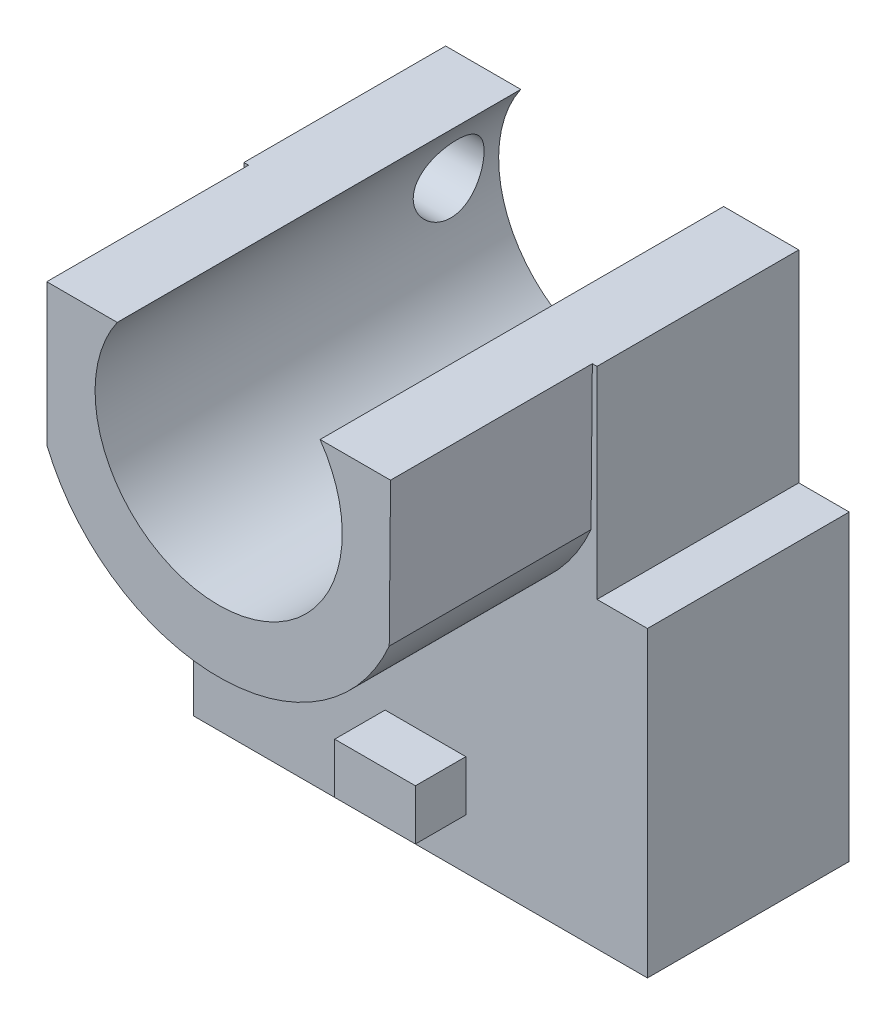
ISO-10303-21;
HEADER;
FILE_DESCRIPTION(('STEP AP214'),'2;1');
FILE_NAME('part.step','',(''),(''),'','','');
FILE_SCHEMA(('AUTOMOTIVE_DESIGN { 1 0 10303 214 1 1 1 1 }'));
ENDSEC;
DATA;
#1=APPLICATION_CONTEXT('core data for automotive mechanical design processes');
#2=APPLICATION_PROTOCOL_DEFINITION('international standard','automotive_design',2000,#1);
#3=PRODUCT_CONTEXT('',#1,'mechanical');
#4=PRODUCT('Part','Part','',(#3));
#5=PRODUCT_RELATED_PRODUCT_CATEGORY('part','',(#4));
#6=PRODUCT_DEFINITION_FORMATION('','',#4);
#7=PRODUCT_DEFINITION_CONTEXT('part definition',#1,'design');
#8=PRODUCT_DEFINITION('design','',#6,#7);
#9=PRODUCT_DEFINITION_SHAPE('','',#8);
#10=(LENGTH_UNIT() NAMED_UNIT(*) SI_UNIT(.MILLI.,.METRE.));
#11=(NAMED_UNIT(*) PLANE_ANGLE_UNIT() SI_UNIT($,.RADIAN.));
#12=(NAMED_UNIT(*) SI_UNIT($,.STERADIAN.) SOLID_ANGLE_UNIT());
#13=UNCERTAINTY_MEASURE_WITH_UNIT(LENGTH_MEASURE(1.E-05),#10,'distance_accuracy_value','');
#14=(GEOMETRIC_REPRESENTATION_CONTEXT(3) GLOBAL_UNCERTAINTY_ASSIGNED_CONTEXT((#13)) GLOBAL_UNIT_ASSIGNED_CONTEXT((#10,
#11,#12)) REPRESENTATION_CONTEXT('',''));
#15=CARTESIAN_POINT('',(0.,0.,0.));
#16=DIRECTION('',(0.,0.,1.));
#17=DIRECTION('',(1.,0.,0.));
#18=AXIS2_PLACEMENT_3D('',#15,#16,#17);
#19=CARTESIAN_POINT('',(0.,28.,0.));
#20=DIRECTION('',(0.,0.,1.));
#21=DIRECTION('',(1.,0.,0.));
#22=AXIS2_PLACEMENT_3D('',#19,#20,#21);
#23=CYLINDRICAL_SURFACE('',#22,12.25);
#24=CARTESIAN_POINT('',(0.,28.,0.));
#25=DIRECTION('',(0.,0.,-1.));
#26=DIRECTION('',(-1.,0.,0.));
#27=AXIS2_PLACEMENT_3D('',#24,#25,#26);
#28=CIRCLE('',#27,12.25);
#29=CARTESIAN_POINT('',(10.0529846314416,35.,0.));
#30=VERTEX_POINT('',#29);
#31=CARTESIAN_POINT('',(-10.0529846314416,35.,0.));
#32=VERTEX_POINT('',#31);
#33=EDGE_CURVE('E11',#30,#32,#28,.T.);
#34=ORIENTED_EDGE('',*,*,#33,.T.);
#35=DIRECTION('',(0.,0.,1.));
#36=VECTOR('',#35,1.);
#37=CARTESIAN_POINT('',(-10.0529846314416,35.,0.));
#38=LINE('',#37,#36);
#39=CARTESIAN_POINT('',(-10.0529846314416,35.,40.));
#40=VERTEX_POINT('',#39);
#41=EDGE_CURVE('E161',#40,#32,#38,.F.);
#42=ORIENTED_EDGE('',*,*,#41,.F.);
#43=CARTESIAN_POINT('',(0.,28.,40.));
#44=DIRECTION('',(0.,0.,-1.));
#45=DIRECTION('',(1.,0.,0.));
#46=AXIS2_PLACEMENT_3D('',#43,#44,#45);
#47=CIRCLE('',#46,12.25);
#48=CARTESIAN_POINT('',(10.0529846314416,35.,40.));
#49=VERTEX_POINT('',#48);
#50=EDGE_CURVE('E165',#49,#40,#47,.T.);
#51=ORIENTED_EDGE('',*,*,#50,.F.);
#52=DIRECTION('',(0.,0.,1.));
#53=VECTOR('',#52,1.);
#54=CARTESIAN_POINT('',(10.0529846314416,35.,0.));
#55=LINE('',#54,#53);
#56=EDGE_CURVE('E51',#30,#49,#55,.T.);
#57=ORIENTED_EDGE('',*,*,#56,.F.);
#58=EDGE_LOOP('',(#34,#42,#51,#57));
#59=FACE_BOUND('',#58,.T.);
#60=CARTESIAN_POINT('',(-12.2091154470748,29.,1.5));
#61=CARTESIAN_POINT('',(-12.1930980872203,29.1955129713642,1.50000503081726));
#62=CARTESIAN_POINT('',(-12.1723402241469,29.3906897416783,1.51643888098676));
#63=CARTESIAN_POINT('',(-12.1223292361413,29.7745963300911,1.58123481318833));
#64=CARTESIAN_POINT('',(-12.0930708422527,29.9633220682555,1.62961672160335));
#65=CARTESIAN_POINT('',(-12.0280366133363,30.328784077885,1.75628851431677));
#66=CARTESIAN_POINT('',(-11.9922739434438,30.5055435957649,1.83451832915782));
#67=CARTESIAN_POINT('',(-11.9167451029964,30.8431766478502,2.01844395063209));
#68=CARTESIAN_POINT('',(-11.8769785649761,31.0040487212554,2.1241422796698));
#69=CARTESIAN_POINT('',(-11.7951225617655,31.3111437164343,2.36412902893623));
#70=CARTESIAN_POINT('',(-11.7529996419516,31.4567171331488,2.49923799481785));
#71=CARTESIAN_POINT('',(-11.6712863629721,31.7233124749416,2.79254649816766));
#72=CARTESIAN_POINT('',(-11.6316964108957,31.8443304603142,2.9507497339208));
#73=CARTESIAN_POINT('',(-11.5583943347316,32.0594467023576,3.28821062937837));
#74=CARTESIAN_POINT('',(-11.5247474977448,32.1532524508381,3.46766981408768));
#75=CARTESIAN_POINT('',(-11.4674764272978,32.3088772408366,3.8414418769287));
#76=CARTESIAN_POINT('',(-11.4438474654366,32.3707113758738,4.03574769627506));
#77=CARTESIAN_POINT('',(-11.410334787606,32.4574457387886,4.42269906832443));
#78=CARTESIAN_POINT('',(-11.3997890108364,32.4841296001002,4.61488691704246));
#79=CARTESIAN_POINT('',(-11.391425416682,32.5053389550787,5.00127804766968));
#80=CARTESIAN_POINT('',(-11.3936034946627,32.4998748194802,5.19548065945074));
#81=CARTESIAN_POINT('',(-11.4099933260017,32.4581371180812,5.57013009655322));
#82=CARTESIAN_POINT('',(-11.4235993188343,32.4234141818151,5.75077983495531));
#83=CARTESIAN_POINT('',(-11.4606429896083,32.3265260485981,6.10348737581292));
#84=CARTESIAN_POINT('',(-11.484081919433,32.2643573573299,6.27554408112145));
#85=CARTESIAN_POINT('',(-11.5391818037293,32.1129530209087,6.6106176462821));
#86=CARTESIAN_POINT('',(-11.5710157952008,32.0231401557345,6.77334422268393));
#87=CARTESIAN_POINT('',(-11.6397955892846,31.8195784330688,7.08186517593523));
#88=CARTESIAN_POINT('',(-11.6767429879684,31.7058220961938,7.22765423976271));
#89=CARTESIAN_POINT('',(-11.7551752643657,31.449264901699,7.50787239670797));
#90=CARTESIAN_POINT('',(-11.79679932443,31.3050817661271,7.64099912040585));
#91=CARTESIAN_POINT('',(-11.8789752459643,30.9963227188584,7.88149302181361));
#92=CARTESIAN_POINT('',(-11.9195268882723,30.8317426772851,7.98885496982024));
#93=CARTESIAN_POINT('',(-11.9973655535853,30.4816624752081,8.17729220176969));
#94=CARTESIAN_POINT('',(-12.0345412817848,30.2957319531434,8.2576173808186));
#95=CARTESIAN_POINT('',(-12.1014967584556,29.9116030411019,8.38524888593171));
#96=CARTESIAN_POINT('',(-12.1312783687501,29.7134077551007,8.43256352942142));
#97=CARTESIAN_POINT('',(-12.1805300119735,29.3174370190392,8.49112091624577));
#98=CARTESIAN_POINT('',(-12.2003141702326,29.1198732073973,8.50352732142497));
#99=CARTESIAN_POINT('',(-12.2301441399152,28.7247695140081,8.49474847533401));
#100=CARTESIAN_POINT('',(-12.2401922876535,28.5272296378992,8.47357128621339));
#101=CARTESIAN_POINT('',(-12.2505626846218,28.145802420457,8.39950749657504));
#102=CARTESIAN_POINT('',(-12.2512419566699,27.9616818355372,8.347863679134));
#103=CARTESIAN_POINT('',(-12.2449154925053,27.6044169835455,8.21537675845554));
#104=CARTESIAN_POINT('',(-12.2379095699848,27.4312729826802,8.13453294737115));
#105=CARTESIAN_POINT('',(-12.2180335411638,27.1001061823282,7.94565372796331));
#106=CARTESIAN_POINT('',(-12.2051429774458,26.9421384802955,7.83752405423797));
#107=CARTESIAN_POINT('',(-12.1758601036594,26.6460802733183,7.59719638365613));
#108=CARTESIAN_POINT('',(-12.1594672178233,26.5079930428981,7.46499442994271));
#109=CARTESIAN_POINT('',(-12.1253090920398,26.2516900148154,7.1760297690231));
#110=CARTESIAN_POINT('',(-12.1075184723445,26.1341272832537,7.01869025217192));
#111=CARTESIAN_POINT('',(-12.0737570567436,25.9268482424985,6.68643974479423));
#112=CARTESIAN_POINT('',(-12.0577863286669,25.8371329709882,6.51152809979674));
#113=CARTESIAN_POINT('',(-12.0300077321576,25.6875817725306,6.14754743318605));
#114=CARTESIAN_POINT('',(-12.0182306309649,25.6279653916063,5.95838563404637));
#115=CARTESIAN_POINT('',(-12.0008389439693,25.5414759713944,5.5724535834886));
#116=CARTESIAN_POINT('',(-11.9952234412438,25.5145980601491,5.37568446864674));
#117=CARTESIAN_POINT('',(-11.9910725888643,25.4946502044732,4.98404256632654));
#118=CARTESIAN_POINT('',(-11.9924076011708,25.5009612560835,4.78920249457696));
#119=CARTESIAN_POINT('',(-12.0016538382016,25.5457554243497,4.40342455701075));
#120=CARTESIAN_POINT('',(-12.0095649863922,25.5842381665884,4.2124866458069));
#121=CARTESIAN_POINT('',(-12.0307081561294,25.6918579725359,3.84094767635159));
#122=CARTESIAN_POINT('',(-12.0439102905753,25.7608230725031,3.66029495899033));
#123=CARTESIAN_POINT('',(-12.0736817879557,25.927361490742,3.31299298091541));
#124=CARTESIAN_POINT('',(-12.090251561829,26.0249383010222,3.14634543270392));
#125=CARTESIAN_POINT('',(-12.1246172861235,26.248115281782,2.82847167564143));
#126=CARTESIAN_POINT('',(-12.1424302323431,26.3741997938702,2.67758718243637));
#127=CARTESIAN_POINT('',(-12.176172019913,26.6499667955782,2.39888949881288));
#128=CARTESIAN_POINT('',(-12.1921006113035,26.799652409756,2.27107936802976));
#129=CARTESIAN_POINT('',(-12.2193801145035,27.119576264496,2.04145135396492));
#130=CARTESIAN_POINT('',(-12.2307026293489,27.2899338368683,1.93979608880252));
#131=CARTESIAN_POINT('',(-12.2461609850595,27.6455720238479,1.7666456384792));
#132=CARTESIAN_POINT('',(-12.2503016024115,27.8308426343193,1.69513043195674));
#133=CARTESIAN_POINT('',(-12.2497151602724,28.1797708498133,1.59343422092879));
#134=CARTESIAN_POINT('',(-12.2463212592972,28.3420405645986,1.55842125359269));
#135=CARTESIAN_POINT('',(-12.2327829442078,28.6696201463996,1.5117024524221));
#136=CARTESIAN_POINT('',(-12.2226387809539,28.8349299002161,1.49999575251963));
#137=CARTESIAN_POINT('',(-12.2091154470748,29.,1.5));
#138=B_SPLINE_CURVE_WITH_KNOTS('',3,(#60,#61,#62,#63,#64,#65,#66,#67,#68,#69,#70,#71,#72,#73,
#74,#75,#76,#77,#78,#79,#80,#81,#82,#83,#84,#85,#86,#87,#88,#89,#90,#91,#92,#93,#94,#95,#96,#97,
#98,#99,#100,#101,#102,#103,#104,#105,#106,#107,#108,#109,#110,#111,#112,#113,#114,#115,#116,
#117,#118,#119,#120,#121,#122,#123,#124,#125,#126,#127,#128,#129,#130,#131,#132,#133,#134,#135,
#136,#137),.UNSPECIFIED.,.T.,.F.,(4,2,2,2,2,2,2,2,2,2,2,2,2,2,2,2,2,2,2,2,2,2,2,2,2,2,2,2,2,2,2,
2,2,2,2,2,2,2,4),(0.,0.587880441932936,1.17612605505794,1.76319400486733,2.35031588356388,
2.95660068582212,3.56298268442801,4.17565980165373,4.78804741467521,5.36798194246394,
5.94772939740565,6.49855423618946,7.0494492246962,7.61273223354822,8.17619146074328,
8.77530107282884,9.37453218880207,9.98923183724972,10.6037765482913,11.1975779538198,
11.7912368316894,12.3622075919216,12.9331921941791,13.5061770685553,14.0792562119081,
14.6681403578694,15.257046444859,15.8501881950818,16.4432416664485,17.0252738430372,
17.6072992459753,18.1860822946576,18.7649360122093,19.3544820489278,19.944106201484,
20.5373122844411,21.1301236904911,21.6264850767771,22.1228280177789),.UNSPECIFIED.);
#139=CARTESIAN_POINT('',(-12.2091154470748,29.,1.5));
#140=VERTEX_POINT('',#139);
#141=EDGE_CURVE('E36',#140,#140,#138,.T.);
#142=ORIENTED_EDGE('',*,*,#141,.F.);
#143=EDGE_LOOP('',(#142));
#144=FACE_BOUND('',#143,.T.);
#145=ADVANCED_FACE('F32',(#59,#144),#23,.F.);
#146=CARTESIAN_POINT('',(0.,0.,20.));
#147=DIRECTION('',(0.,0.,-1.));
#148=DIRECTION('',(-1.,0.,0.));
#149=AXIS2_PLACEMENT_3D('',#146,#147,#148);
#150=PLANE('',#149);
#151=DIRECTION('',(-1.,0.,0.));
#152=VECTOR('',#151,1.);
#153=CARTESIAN_POINT('',(4.5,-5.,20.));
#154=LINE('',#153,#152);
#155=CARTESIAN_POINT('',(4.5,-5.,20.));
#156=VERTEX_POINT('',#155);
#157=CARTESIAN_POINT('',(-3.5,-5.,20.));
#158=VERTEX_POINT('',#157);
#159=EDGE_CURVE('E214',#156,#158,#154,.T.);
#160=ORIENTED_EDGE('',*,*,#159,.F.);
#161=DIRECTION('',(0.,-1.,0.));
#162=VECTOR('',#161,1.);
#163=CARTESIAN_POINT('',(4.5,-5.,20.));
#164=LINE('',#163,#162);
#165=CARTESIAN_POINT('',(4.5,-10.,20.));
#166=VERTEX_POINT('',#165);
#167=EDGE_CURVE('E209',#156,#166,#164,.T.);
#168=ORIENTED_EDGE('',*,*,#167,.T.);
#169=DIRECTION('',(-1.,0.,0.));
#170=VECTOR('',#169,1.);
#171=CARTESIAN_POINT('',(4.5,-10.,20.));
#172=LINE('',#171,#170);
#173=CARTESIAN_POINT('',(-3.5,-10.,20.));
#174=VERTEX_POINT('',#173);
#175=EDGE_CURVE('E224',#166,#174,#172,.T.);
#176=ORIENTED_EDGE('',*,*,#175,.T.);
#177=DIRECTION('',(0.,-1.,0.));
#178=VECTOR('',#177,1.);
#179=CARTESIAN_POINT('',(-3.5,-5.,20.));
#180=LINE('',#179,#178);
#181=EDGE_CURVE('E59',#158,#174,#180,.T.);
#182=ORIENTED_EDGE('',*,*,#181,.F.);
#183=EDGE_LOOP('',(#160,#168,#176,#182));
#184=FACE_BOUND('',#183,.T.);
#185=DIRECTION('',(0.,-1.,0.));
#186=VECTOR('',#185,1.);
#187=CARTESIAN_POINT('',(-17.0367250374008,35.,20.));
#188=LINE('',#187,#186);
#189=CARTESIAN_POINT('',(-17.0367250374008,35.,20.));
#190=VERTEX_POINT('',#189);
#191=CARTESIAN_POINT('',(-17.0367250374008,21.,20.));
#192=VERTEX_POINT('',#191);
#193=EDGE_CURVE('E196',#190,#192,#188,.T.);
#194=ORIENTED_EDGE('',*,*,#193,.F.);
#195=DIRECTION('',(-1.,0.,0.));
#196=VECTOR('',#195,1.);
#197=CARTESIAN_POINT('',(-17.5,35.,20.));
#198=LINE('',#197,#196);
#199=CARTESIAN_POINT('',(-17.5,35.,20.));
#200=VERTEX_POINT('',#199);
#201=EDGE_CURVE('E245',#190,#200,#198,.T.);
#202=ORIENTED_EDGE('',*,*,#201,.T.);
#203=DIRECTION('',(0.,-1.,0.));
#204=VECTOR('',#203,1.);
#205=CARTESIAN_POINT('',(-17.5,15.,20.));
#206=LINE('',#205,#204);
#207=CARTESIAN_POINT('',(-17.5,15.,20.));
#208=VERTEX_POINT('',#207);
#209=EDGE_CURVE('E249',#200,#208,#206,.T.);
#210=ORIENTED_EDGE('',*,*,#209,.T.);
#211=DIRECTION('',(-1.,0.,0.));
#212=VECTOR('',#211,1.);
#213=CARTESIAN_POINT('',(-22.5,15.,20.));
#214=LINE('',#213,#212);
#215=CARTESIAN_POINT('',(-22.5,15.,20.));
#216=VERTEX_POINT('',#215);
#217=EDGE_CURVE('E251',#208,#216,#214,.T.);
#218=ORIENTED_EDGE('',*,*,#217,.T.);
#219=DIRECTION('',(0.,-1.,0.));
#220=VECTOR('',#219,1.);
#221=CARTESIAN_POINT('',(-22.5,-15.,20.));
#222=LINE('',#221,#220);
#223=CARTESIAN_POINT('',(-22.5,-15.,20.));
#224=VERTEX_POINT('',#223);
#225=EDGE_CURVE('E253',#216,#224,#222,.T.);
#226=ORIENTED_EDGE('',*,*,#225,.T.);
#227=DIRECTION('',(1.,0.,0.));
#228=VECTOR('',#227,1.);
#229=CARTESIAN_POINT('',(-22.5,-15.,20.));
#230=LINE('',#229,#228);
#231=CARTESIAN_POINT('',(22.5,-15.,20.));
#232=VERTEX_POINT('',#231);
#233=EDGE_CURVE('E255',#224,#232,#230,.T.);
#234=ORIENTED_EDGE('',*,*,#233,.T.);
#235=DIRECTION('',(0.,1.,0.));
#236=VECTOR('',#235,1.);
#237=CARTESIAN_POINT('',(22.5,-15.,20.));
#238=LINE('',#237,#236);
#239=CARTESIAN_POINT('',(22.5,15.,20.));
#240=VERTEX_POINT('',#239);
#241=EDGE_CURVE('E237',#232,#240,#238,.T.);
#242=ORIENTED_EDGE('',*,*,#241,.T.);
#243=DIRECTION('',(-1.,0.,0.));
#244=VECTOR('',#243,1.);
#245=CARTESIAN_POINT('',(17.5,15.,20.));
#246=LINE('',#245,#244);
#247=CARTESIAN_POINT('',(17.5,15.,20.));
#248=VERTEX_POINT('',#247);
#249=EDGE_CURVE('E240',#240,#248,#246,.T.);
#250=ORIENTED_EDGE('',*,*,#249,.T.);
#251=DIRECTION('',(0.,1.,0.));
#252=VECTOR('',#251,1.);
#253=CARTESIAN_POINT('',(17.5,15.,20.));
#254=LINE('',#253,#252);
#255=CARTESIAN_POINT('',(17.5,35.,20.));
#256=VERTEX_POINT('',#255);
#257=EDGE_CURVE('E243',#248,#256,#254,.T.);
#258=ORIENTED_EDGE('',*,*,#257,.T.);
#259=CARTESIAN_POINT('',(17.0367250374008,35.,20.));
#260=VERTEX_POINT('',#259);
#261=EDGE_CURVE('E246',#256,#260,#198,.T.);
#262=ORIENTED_EDGE('',*,*,#261,.T.);
#263=DIRECTION('',(0.0090933515019987,0.999958654624511,0.));
#264=VECTOR('',#263,1.);
#265=CARTESIAN_POINT('',(17.0367250374008,35.,20.));
#266=LINE('',#265,#264);
#267=CARTESIAN_POINT('',(16.9066058789967,20.6913285986936,20.));
#268=VERTEX_POINT('',#267);
#269=EDGE_CURVE('E182',#268,#260,#266,.T.);
#270=ORIENTED_EDGE('',*,*,#269,.F.);
#271=CARTESIAN_POINT('',(0.,28.,20.));
#272=DIRECTION('',(0.,0.,1.));
#273=DIRECTION('',(1.,0.,0.));
#274=AXIS2_PLACEMENT_3D('',#271,#272,#273);
#275=CIRCLE('',#274,18.4187404563939);
#276=EDGE_CURVE('E184',#192,#268,#275,.T.);
#277=ORIENTED_EDGE('',*,*,#276,.F.);
#278=EDGE_LOOP('',(#194,#202,#210,#218,#226,#234,#242,#250,#258,#262,#270,#277));
#279=FACE_BOUND('',#278,.T.);
#280=ADVANCED_FACE('F321',(#184,#279),#150,.F.);
#281=CARTESIAN_POINT('',(-17.5,35.,20.));
#282=DIRECTION('',(0.,-1.,0.));
#283=DIRECTION('',(0.,0.,-1.));
#284=AXIS2_PLACEMENT_3D('',#281,#282,#283);
#285=PLANE('',#284);
#286=DIRECTION('',(-1.,0.,0.));
#287=VECTOR('',#286,1.);
#288=CARTESIAN_POINT('',(-17.5,35.,0.));
#289=LINE('',#288,#287);
#290=CARTESIAN_POINT('',(17.5,35.,0.));
#291=VERTEX_POINT('',#290);
#292=EDGE_CURVE('E265',#291,#30,#289,.T.);
#293=ORIENTED_EDGE('',*,*,#292,.T.);
#294=ORIENTED_EDGE('',*,*,#56,.T.);
#295=DIRECTION('',(-1.,0.,0.));
#296=VECTOR('',#295,1.);
#297=CARTESIAN_POINT('',(10.0529846314416,35.,40.));
#298=LINE('',#297,#296);
#299=CARTESIAN_POINT('',(17.0367250374008,35.,40.));
#300=VERTEX_POINT('',#299);
#301=EDGE_CURVE('E181',#300,#49,#298,.T.);
#302=ORIENTED_EDGE('',*,*,#301,.F.);
#303=DIRECTION('',(0.,0.,-1.));
#304=VECTOR('',#303,1.);
#305=CARTESIAN_POINT('',(17.0367250374008,35.,40.));
#306=LINE('',#305,#304);
#307=EDGE_CURVE('E195',#300,#260,#306,.T.);
#308=ORIENTED_EDGE('',*,*,#307,.T.);
#309=ORIENTED_EDGE('',*,*,#261,.F.);
#310=DIRECTION('',(0.,0.,-1.));
#311=VECTOR('',#310,1.);
#312=CARTESIAN_POINT('',(17.5,35.,20.));
#313=LINE('',#312,#311);
#314=EDGE_CURVE('E289',#256,#291,#313,.T.);
#315=ORIENTED_EDGE('',*,*,#314,.T.);
#316=EDGE_LOOP('',(#293,#294,#302,#308,#309,#315));
#317=FACE_BOUND('',#316,.T.);
#318=ADVANCED_FACE('F316',(#317),#285,.F.);
#319=CARTESIAN_POINT('',(22.5,-15.,20.));
#320=DIRECTION('',(-1.,0.,0.));
#321=DIRECTION('',(0.,0.,1.));
#322=AXIS2_PLACEMENT_3D('',#319,#320,#321);
#323=PLANE('',#322);
#324=DIRECTION('',(0.,1.,0.));
#325=VECTOR('',#324,1.);
#326=CARTESIAN_POINT('',(22.5,-15.,0.));
#327=LINE('',#326,#325);
#328=CARTESIAN_POINT('',(22.5,-15.,0.));
#329=VERTEX_POINT('',#328);
#330=CARTESIAN_POINT('',(22.5,15.,0.));
#331=VERTEX_POINT('',#330);
#332=EDGE_CURVE('E231',#329,#331,#327,.T.);
#333=ORIENTED_EDGE('',*,*,#332,.T.);
#334=DIRECTION('',(0.,0.,-1.));
#335=VECTOR('',#334,1.);
#336=CARTESIAN_POINT('',(22.5,15.,20.));
#337=LINE('',#336,#335);
#338=EDGE_CURVE('E45',#240,#331,#337,.T.);
#339=ORIENTED_EDGE('',*,*,#338,.F.);
#340=ORIENTED_EDGE('',*,*,#241,.F.);
#341=DIRECTION('',(0.,0.,-1.));
#342=VECTOR('',#341,1.);
#343=CARTESIAN_POINT('',(22.5,-15.,20.));
#344=LINE('',#343,#342);
#345=EDGE_CURVE('E257',#232,#329,#344,.T.);
#346=ORIENTED_EDGE('',*,*,#345,.T.);
#347=EDGE_LOOP('',(#333,#339,#340,#346));
#348=FACE_BOUND('',#347,.T.);
#349=ADVANCED_FACE('F34',(#348),#323,.F.);
#350=CARTESIAN_POINT('',(17.5,15.,20.));
#351=DIRECTION('',(0.,-1.,0.));
#352=DIRECTION('',(0.,0.,-1.));
#353=AXIS2_PLACEMENT_3D('',#350,#351,#352);
#354=PLANE('',#353);
#355=DIRECTION('',(-1.,0.,0.));
#356=VECTOR('',#355,1.);
#357=CARTESIAN_POINT('',(17.5,15.,0.));
#358=LINE('',#357,#356);
#359=CARTESIAN_POINT('',(17.5,15.,0.));
#360=VERTEX_POINT('',#359);
#361=EDGE_CURVE('E260',#331,#360,#358,.T.);
#362=ORIENTED_EDGE('',*,*,#361,.T.);
#363=DIRECTION('',(0.,0.,-1.));
#364=VECTOR('',#363,1.);
#365=CARTESIAN_POINT('',(17.5,15.,20.));
#366=LINE('',#365,#364);
#367=EDGE_CURVE('E292',#248,#360,#366,.T.);
#368=ORIENTED_EDGE('',*,*,#367,.F.);
#369=ORIENTED_EDGE('',*,*,#249,.F.);
#370=ORIENTED_EDGE('',*,*,#338,.T.);
#371=EDGE_LOOP('',(#362,#368,#369,#370));
#372=FACE_BOUND('',#371,.T.);
#373=ADVANCED_FACE('F298',(#372),#354,.F.);
#374=CARTESIAN_POINT('',(17.5,15.,20.));
#375=DIRECTION('',(-1.,0.,0.));
#376=DIRECTION('',(0.,0.,1.));
#377=AXIS2_PLACEMENT_3D('',#374,#375,#376);
#378=PLANE('',#377);
#379=DIRECTION('',(0.,1.,0.));
#380=VECTOR('',#379,1.);
#381=CARTESIAN_POINT('',(17.5,15.,0.));
#382=LINE('',#381,#380);
#383=EDGE_CURVE('E262',#360,#291,#382,.T.);
#384=ORIENTED_EDGE('',*,*,#383,.T.);
#385=ORIENTED_EDGE('',*,*,#314,.F.);
#386=ORIENTED_EDGE('',*,*,#257,.F.);
#387=ORIENTED_EDGE('',*,*,#367,.T.);
#388=EDGE_LOOP('',(#384,#385,#386,#387));
#389=FACE_BOUND('',#388,.T.);
#390=ADVANCED_FACE('F312',(#389),#378,.F.);
#391=ORIENTED_EDGE('',*,*,#201,.F.);
#392=DIRECTION('',(0.,0.,-1.));
#393=VECTOR('',#392,1.);
#394=CARTESIAN_POINT('',(-17.0367250374008,35.,40.));
#395=LINE('',#394,#393);
#396=CARTESIAN_POINT('',(-17.0367250374008,35.,40.));
#397=VERTEX_POINT('',#396);
#398=EDGE_CURVE('E168',#397,#190,#395,.T.);
#399=ORIENTED_EDGE('',*,*,#398,.F.);
#400=DIRECTION('',(-1.,0.,0.));
#401=VECTOR('',#400,1.);
#402=CARTESIAN_POINT('',(-17.0367250374008,35.,40.));
#403=LINE('',#402,#401);
#404=EDGE_CURVE('E171',#40,#397,#403,.T.);
#405=ORIENTED_EDGE('',*,*,#404,.F.);
#406=ORIENTED_EDGE('',*,*,#41,.T.);
#407=CARTESIAN_POINT('',(-17.5,35.,0.));
#408=VERTEX_POINT('',#407);
#409=EDGE_CURVE('E264',#32,#408,#289,.T.);
#410=ORIENTED_EDGE('',*,*,#409,.T.);
#411=DIRECTION('',(0.,0.,-1.));
#412=VECTOR('',#411,1.);
#413=CARTESIAN_POINT('',(-17.5,35.,20.));
#414=LINE('',#413,#412);
#415=EDGE_CURVE('E286',#200,#408,#414,.T.);
#416=ORIENTED_EDGE('',*,*,#415,.F.);
#417=EDGE_LOOP('',(#391,#399,#405,#406,#410,#416));
#418=FACE_BOUND('',#417,.T.);
#419=ADVANCED_FACE('F173',(#418),#285,.F.);
#420=CARTESIAN_POINT('',(-17.5,15.,20.));
#421=DIRECTION('',(1.,0.,0.));
#422=DIRECTION('',(0.,0.,-1.));
#423=AXIS2_PLACEMENT_3D('',#420,#421,#422);
#424=PLANE('',#423);
#425=CARTESIAN_POINT('',(-17.5,29.,5.));
#426=DIRECTION('',(1.,0.,0.));
#427=DIRECTION('',(0.,0.,-1.));
#428=AXIS2_PLACEMENT_3D('',#425,#426,#427);
#429=CIRCLE('',#428,3.5);
#430=CARTESIAN_POINT('',(-17.5,29.,1.5));
#431=VERTEX_POINT('',#430);
#432=EDGE_CURVE('E187',#431,#431,#429,.F.);
#433=ORIENTED_EDGE('',*,*,#432,.F.);
#434=EDGE_LOOP('',(#433));
#435=FACE_BOUND('',#434,.T.);
#436=DIRECTION('',(0.,-1.,0.));
#437=VECTOR('',#436,1.);
#438=CARTESIAN_POINT('',(-17.5,15.,0.));
#439=LINE('',#438,#437);
#440=CARTESIAN_POINT('',(-17.5,15.,0.));
#441=VERTEX_POINT('',#440);
#442=EDGE_CURVE('E268',#408,#441,#439,.T.);
#443=ORIENTED_EDGE('',*,*,#442,.T.);
#444=DIRECTION('',(0.,0.,-1.));
#445=VECTOR('',#444,1.);
#446=CARTESIAN_POINT('',(-17.5,15.,20.));
#447=LINE('',#446,#445);
#448=EDGE_CURVE('E283',#208,#441,#447,.T.);
#449=ORIENTED_EDGE('',*,*,#448,.F.);
#450=ORIENTED_EDGE('',*,*,#209,.F.);
#451=ORIENTED_EDGE('',*,*,#415,.T.);
#452=EDGE_LOOP('',(#443,#449,#450,#451));
#453=FACE_BOUND('',#452,.T.);
#454=ADVANCED_FACE('F339',(#435,#453),#424,.F.);
#455=CARTESIAN_POINT('',(-22.5,15.,20.));
#456=DIRECTION('',(0.,-1.,0.));
#457=DIRECTION('',(0.,0.,-1.));
#458=AXIS2_PLACEMENT_3D('',#455,#456,#457);
#459=PLANE('',#458);
#460=DIRECTION('',(-1.,0.,0.));
#461=VECTOR('',#460,1.);
#462=CARTESIAN_POINT('',(-22.5,15.,0.));
#463=LINE('',#462,#461);
#464=CARTESIAN_POINT('',(-22.5,15.,0.));
#465=VERTEX_POINT('',#464);
#466=EDGE_CURVE('E270',#441,#465,#463,.T.);
#467=ORIENTED_EDGE('',*,*,#466,.T.);
#468=DIRECTION('',(0.,0.,-1.));
#469=VECTOR('',#468,1.);
#470=CARTESIAN_POINT('',(-22.5,15.,20.));
#471=LINE('',#470,#469);
#472=EDGE_CURVE('E280',#216,#465,#471,.T.);
#473=ORIENTED_EDGE('',*,*,#472,.F.);
#474=ORIENTED_EDGE('',*,*,#217,.F.);
#475=ORIENTED_EDGE('',*,*,#448,.T.);
#476=EDGE_LOOP('',(#467,#473,#474,#475));
#477=FACE_BOUND('',#476,.T.);
#478=ADVANCED_FACE('F334',(#477),#459,.F.);
#479=CARTESIAN_POINT('',(-22.5,-15.,20.));
#480=DIRECTION('',(1.,0.,0.));
#481=DIRECTION('',(0.,0.,-1.));
#482=AXIS2_PLACEMENT_3D('',#479,#480,#481);
#483=PLANE('',#482);
#484=DIRECTION('',(0.,-1.,0.));
#485=VECTOR('',#484,1.);
#486=CARTESIAN_POINT('',(-22.5,-15.,0.));
#487=LINE('',#486,#485);
#488=CARTESIAN_POINT('',(-22.5,-15.,0.));
#489=VERTEX_POINT('',#488);
#490=EDGE_CURVE('E272',#465,#489,#487,.T.);
#491=ORIENTED_EDGE('',*,*,#490,.T.);
#492=DIRECTION('',(0.,0.,-1.));
#493=VECTOR('',#492,1.);
#494=CARTESIAN_POINT('',(-22.5,-15.,20.));
#495=LINE('',#494,#493);
#496=EDGE_CURVE('E277',#224,#489,#495,.T.);
#497=ORIENTED_EDGE('',*,*,#496,.F.);
#498=ORIENTED_EDGE('',*,*,#225,.F.);
#499=ORIENTED_EDGE('',*,*,#472,.T.);
#500=EDGE_LOOP('',(#491,#497,#498,#499));
#501=FACE_BOUND('',#500,.T.);
#502=ADVANCED_FACE('F329',(#501),#483,.F.);
#503=CARTESIAN_POINT('',(-22.5,-15.,20.));
#504=DIRECTION('',(0.,1.,0.));
#505=DIRECTION('',(-1.,0.,0.));
#506=AXIS2_PLACEMENT_3D('',#503,#504,#505);
#507=PLANE('',#506);
#508=DIRECTION('',(1.,0.,0.));
#509=VECTOR('',#508,1.);
#510=CARTESIAN_POINT('',(-22.5,-15.,0.));
#511=LINE('',#510,#509);
#512=EDGE_CURVE('E241',#489,#329,#511,.T.);
#513=ORIENTED_EDGE('',*,*,#512,.T.);
#514=ORIENTED_EDGE('',*,*,#345,.F.);
#515=ORIENTED_EDGE('',*,*,#233,.F.);
#516=ORIENTED_EDGE('',*,*,#496,.T.);
#517=EDGE_LOOP('',(#513,#514,#515,#516));
#518=FACE_BOUND('',#517,.T.);
#519=ADVANCED_FACE('F327',(#518),#507,.F.);
#520=CARTESIAN_POINT('',(0.,0.,0.));
#521=DIRECTION('',(0.,0.,-1.));
#522=DIRECTION('',(-1.,0.,0.));
#523=AXIS2_PLACEMENT_3D('',#520,#521,#522);
#524=PLANE('',#523);
#525=ORIENTED_EDGE('',*,*,#33,.F.);
#526=ORIENTED_EDGE('',*,*,#292,.F.);
#527=ORIENTED_EDGE('',*,*,#383,.F.);
#528=ORIENTED_EDGE('',*,*,#361,.F.);
#529=ORIENTED_EDGE('',*,*,#332,.F.);
#530=ORIENTED_EDGE('',*,*,#512,.F.);
#531=ORIENTED_EDGE('',*,*,#490,.F.);
#532=ORIENTED_EDGE('',*,*,#466,.F.);
#533=ORIENTED_EDGE('',*,*,#442,.F.);
#534=ORIENTED_EDGE('',*,*,#409,.F.);
#535=EDGE_LOOP('',(#525,#526,#527,#528,#529,#530,#531,#532,#533,#534));
#536=FACE_BOUND('',#535,.T.);
#537=ADVANCED_FACE('F306',(#536),#524,.T.);
#538=CARTESIAN_POINT('',(4.5,-5.,25.));
#539=DIRECTION('',(1.,0.,0.));
#540=DIRECTION('',(0.,1.,0.));
#541=AXIS2_PLACEMENT_3D('',#538,#539,#540);
#542=PLANE('',#541);
#543=ORIENTED_EDGE('',*,*,#167,.F.);
#544=DIRECTION('',(0.,0.,-1.));
#545=VECTOR('',#544,1.);
#546=CARTESIAN_POINT('',(4.5,-5.,25.));
#547=LINE('',#546,#545);
#548=CARTESIAN_POINT('',(4.5,-5.,25.));
#549=VERTEX_POINT('',#548);
#550=EDGE_CURVE('E229',#549,#156,#547,.T.);
#551=ORIENTED_EDGE('',*,*,#550,.F.);
#552=DIRECTION('',(0.,-1.,0.));
#553=VECTOR('',#552,1.);
#554=CARTESIAN_POINT('',(4.5,-5.,25.));
#555=LINE('',#554,#553);
#556=CARTESIAN_POINT('',(4.5,-10.,25.));
#557=VERTEX_POINT('',#556);
#558=EDGE_CURVE('E210',#549,#557,#555,.T.);
#559=ORIENTED_EDGE('',*,*,#558,.T.);
#560=DIRECTION('',(0.,0.,-1.));
#561=VECTOR('',#560,1.);
#562=CARTESIAN_POINT('',(4.5,-10.,25.));
#563=LINE('',#562,#561);
#564=EDGE_CURVE('E221',#557,#166,#563,.T.);
#565=ORIENTED_EDGE('',*,*,#564,.T.);
#566=EDGE_LOOP('',(#543,#551,#559,#565));
#567=FACE_BOUND('',#566,.T.);
#568=ADVANCED_FACE('F378',(#567),#542,.T.);
#569=CARTESIAN_POINT('',(4.5,-5.,25.));
#570=DIRECTION('',(0.,-1.,0.));
#571=DIRECTION('',(1.,0.,0.));
#572=AXIS2_PLACEMENT_3D('',#569,#570,#571);
#573=PLANE('',#572);
#574=ORIENTED_EDGE('',*,*,#159,.T.);
#575=DIRECTION('',(0.,0.,-1.));
#576=VECTOR('',#575,1.);
#577=CARTESIAN_POINT('',(-3.5,-5.,25.));
#578=LINE('',#577,#576);
#579=CARTESIAN_POINT('',(-3.5,-5.,25.));
#580=VERTEX_POINT('',#579);
#581=EDGE_CURVE('E232',#580,#158,#578,.T.);
#582=ORIENTED_EDGE('',*,*,#581,.F.);
#583=DIRECTION('',(-1.,0.,0.));
#584=VECTOR('',#583,1.);
#585=CARTESIAN_POINT('',(4.5,-5.,25.));
#586=LINE('',#585,#584);
#587=EDGE_CURVE('E219',#549,#580,#586,.T.);
#588=ORIENTED_EDGE('',*,*,#587,.F.);
#589=ORIENTED_EDGE('',*,*,#550,.T.);
#590=EDGE_LOOP('',(#574,#582,#588,#589));
#591=FACE_BOUND('',#590,.T.);
#592=ADVANCED_FACE('F374',(#591),#573,.F.);
#593=CARTESIAN_POINT('',(-3.5,-5.,25.));
#594=DIRECTION('',(1.,0.,0.));
#595=DIRECTION('',(0.,1.,0.));
#596=AXIS2_PLACEMENT_3D('',#593,#594,#595);
#597=PLANE('',#596);
#598=ORIENTED_EDGE('',*,*,#181,.T.);
#599=DIRECTION('',(0.,0.,-1.));
#600=VECTOR('',#599,1.);
#601=CARTESIAN_POINT('',(-3.5,-10.,25.));
#602=LINE('',#601,#600);
#603=CARTESIAN_POINT('',(-3.5,-10.,25.));
#604=VERTEX_POINT('',#603);
#605=EDGE_CURVE('E234',#604,#174,#602,.T.);
#606=ORIENTED_EDGE('',*,*,#605,.F.);
#607=DIRECTION('',(0.,-1.,0.));
#608=VECTOR('',#607,1.);
#609=CARTESIAN_POINT('',(-3.5,-5.,25.));
#610=LINE('',#609,#608);
#611=EDGE_CURVE('E217',#580,#604,#610,.T.);
#612=ORIENTED_EDGE('',*,*,#611,.F.);
#613=ORIENTED_EDGE('',*,*,#581,.T.);
#614=EDGE_LOOP('',(#598,#606,#612,#613));
#615=FACE_BOUND('',#614,.T.);
#616=ADVANCED_FACE('F377',(#615),#597,.F.);
#617=CARTESIAN_POINT('',(4.5,-10.,25.));
#618=DIRECTION('',(0.,-1.,0.));
#619=DIRECTION('',(1.,0.,0.));
#620=AXIS2_PLACEMENT_3D('',#617,#618,#619);
#621=PLANE('',#620);
#622=ORIENTED_EDGE('',*,*,#175,.F.);
#623=ORIENTED_EDGE('',*,*,#564,.F.);
#624=DIRECTION('',(-1.,0.,0.));
#625=VECTOR('',#624,1.);
#626=CARTESIAN_POINT('',(4.5,-10.,25.));
#627=LINE('',#626,#625);
#628=EDGE_CURVE('E213',#557,#604,#627,.T.);
#629=ORIENTED_EDGE('',*,*,#628,.T.);
#630=ORIENTED_EDGE('',*,*,#605,.T.);
#631=EDGE_LOOP('',(#622,#623,#629,#630));
#632=FACE_BOUND('',#631,.T.);
#633=ADVANCED_FACE('F372',(#632),#621,.T.);
#634=CARTESIAN_POINT('',(0.,0.,25.));
#635=DIRECTION('',(0.,0.,-1.));
#636=DIRECTION('',(-1.,0.,0.));
#637=AXIS2_PLACEMENT_3D('',#634,#635,#636);
#638=PLANE('',#637);
#639=ORIENTED_EDGE('',*,*,#558,.F.);
#640=ORIENTED_EDGE('',*,*,#587,.T.);
#641=ORIENTED_EDGE('',*,*,#611,.T.);
#642=ORIENTED_EDGE('',*,*,#628,.F.);
#643=EDGE_LOOP('',(#639,#640,#641,#642));
#644=FACE_BOUND('',#643,.T.);
#645=ADVANCED_FACE('F369',(#644),#638,.F.);
#646=CARTESIAN_POINT('',(-17.0367250374008,35.,40.));
#647=DIRECTION('',(1.,0.,0.));
#648=DIRECTION('',(0.,0.,-1.));
#649=AXIS2_PLACEMENT_3D('',#646,#647,#648);
#650=PLANE('',#649);
#651=ORIENTED_EDGE('',*,*,#193,.T.);
#652=DIRECTION('',(0.,0.,-1.));
#653=VECTOR('',#652,1.);
#654=CARTESIAN_POINT('',(-17.0367250374008,21.,40.));
#655=LINE('',#654,#653);
#656=CARTESIAN_POINT('',(-17.0367250374008,21.,40.));
#657=VERTEX_POINT('',#656);
#658=EDGE_CURVE('E204',#657,#192,#655,.T.);
#659=ORIENTED_EDGE('',*,*,#658,.F.);
#660=DIRECTION('',(0.,-1.,0.));
#661=VECTOR('',#660,1.);
#662=CARTESIAN_POINT('',(-17.0367250374008,35.,40.));
#663=LINE('',#662,#661);
#664=EDGE_CURVE('E176',#397,#657,#663,.T.);
#665=ORIENTED_EDGE('',*,*,#664,.F.);
#666=ORIENTED_EDGE('',*,*,#398,.T.);
#667=EDGE_LOOP('',(#651,#659,#665,#666));
#668=FACE_BOUND('',#667,.T.);
#669=ADVANCED_FACE('F343',(#668),#650,.F.);
#670=CARTESIAN_POINT('',(0.,28.,40.));
#671=DIRECTION('',(0.,0.,-1.));
#672=DIRECTION('',(-1.,0.,0.));
#673=AXIS2_PLACEMENT_3D('',#670,#671,#672);
#674=CYLINDRICAL_SURFACE('',#673,18.4187404563939);
#675=ORIENTED_EDGE('',*,*,#276,.T.);
#676=DIRECTION('',(0.,0.,-1.));
#677=VECTOR('',#676,1.);
#678=CARTESIAN_POINT('',(16.9066058789967,20.6913285986936,40.));
#679=LINE('',#678,#677);
#680=CARTESIAN_POINT('',(16.9066058789967,20.6913285986936,40.));
#681=VERTEX_POINT('',#680);
#682=EDGE_CURVE('E201',#681,#268,#679,.T.);
#683=ORIENTED_EDGE('',*,*,#682,.F.);
#684=CARTESIAN_POINT('',(0.,28.,40.));
#685=DIRECTION('',(0.,0.,1.));
#686=DIRECTION('',(1.,0.,0.));
#687=AXIS2_PLACEMENT_3D('',#684,#685,#686);
#688=CIRCLE('',#687,18.4187404563939);
#689=EDGE_CURVE('E190',#657,#681,#688,.T.);
#690=ORIENTED_EDGE('',*,*,#689,.F.);
#691=ORIENTED_EDGE('',*,*,#658,.T.);
#692=EDGE_LOOP('',(#675,#683,#690,#691));
#693=FACE_BOUND('',#692,.T.);
#694=ADVANCED_FACE('F346',(#693),#674,.T.);
#695=CARTESIAN_POINT('',(17.0367250374008,35.,40.));
#696=DIRECTION('',(-0.999958654624511,0.0090933515019987,0.));
#697=DIRECTION('',(-0.0090933515019987,-0.999958654624511,0.));
#698=AXIS2_PLACEMENT_3D('',#695,#696,#697);
#699=PLANE('',#698);
#700=ORIENTED_EDGE('',*,*,#269,.T.);
#701=ORIENTED_EDGE('',*,*,#307,.F.);
#702=DIRECTION('',(0.0090933515019987,0.999958654624511,0.));
#703=VECTOR('',#702,1.);
#704=CARTESIAN_POINT('',(17.0367250374008,35.,40.));
#705=LINE('',#704,#703);
#706=EDGE_CURVE('E192',#681,#300,#705,.T.);
#707=ORIENTED_EDGE('',*,*,#706,.F.);
#708=ORIENTED_EDGE('',*,*,#682,.T.);
#709=EDGE_LOOP('',(#700,#701,#707,#708));
#710=FACE_BOUND('',#709,.T.);
#711=ADVANCED_FACE('F350',(#710),#699,.F.);
#712=CARTESIAN_POINT('',(0.,28.,40.));
#713=DIRECTION('',(0.,0.,1.));
#714=DIRECTION('',(1.,0.,0.));
#715=AXIS2_PLACEMENT_3D('',#712,#713,#714);
#716=PLANE('',#715);
#717=ORIENTED_EDGE('',*,*,#50,.T.);
#718=ORIENTED_EDGE('',*,*,#404,.T.);
#719=ORIENTED_EDGE('',*,*,#664,.T.);
#720=ORIENTED_EDGE('',*,*,#689,.T.);
#721=ORIENTED_EDGE('',*,*,#706,.T.);
#722=ORIENTED_EDGE('',*,*,#301,.T.);
#723=EDGE_LOOP('',(#717,#718,#719,#720,#721,#722));
#724=FACE_BOUND('',#723,.T.);
#725=ADVANCED_FACE('F179',(#724),#716,.T.);
#726=CARTESIAN_POINT('',(-18.5,29.,5.));
#727=DIRECTION('',(1.,0.,0.));
#728=DIRECTION('',(0.,0.,-1.));
#729=AXIS2_PLACEMENT_3D('',#726,#727,#728);
#730=CYLINDRICAL_SURFACE('',#729,3.5);
#731=ORIENTED_EDGE('',*,*,#141,.T.);
#732=EDGE_LOOP('',(#731));
#733=FACE_BOUND('',#732,.T.);
#734=ORIENTED_EDGE('',*,*,#432,.T.);
#735=EDGE_LOOP('',(#734));
#736=FACE_BOUND('',#735,.T.);
#737=ADVANCED_FACE('F357',(#733,#736),#730,.F.);
#738=CLOSED_SHELL('',(#145,#280,#318,#349,#373,#390,#419,#454,#478,#502,#519,#537,#568,#592,
#616,#633,#645,#669,#694,#711,#725,#737));
#739=MANIFOLD_SOLID_BREP('B2',#738);
#740=ADVANCED_BREP_SHAPE_REPRESENTATION('',(#18,#739),#14);
#741=SHAPE_DEFINITION_REPRESENTATION(#9,#740);
ENDSEC;
END-ISO-10303-21;
